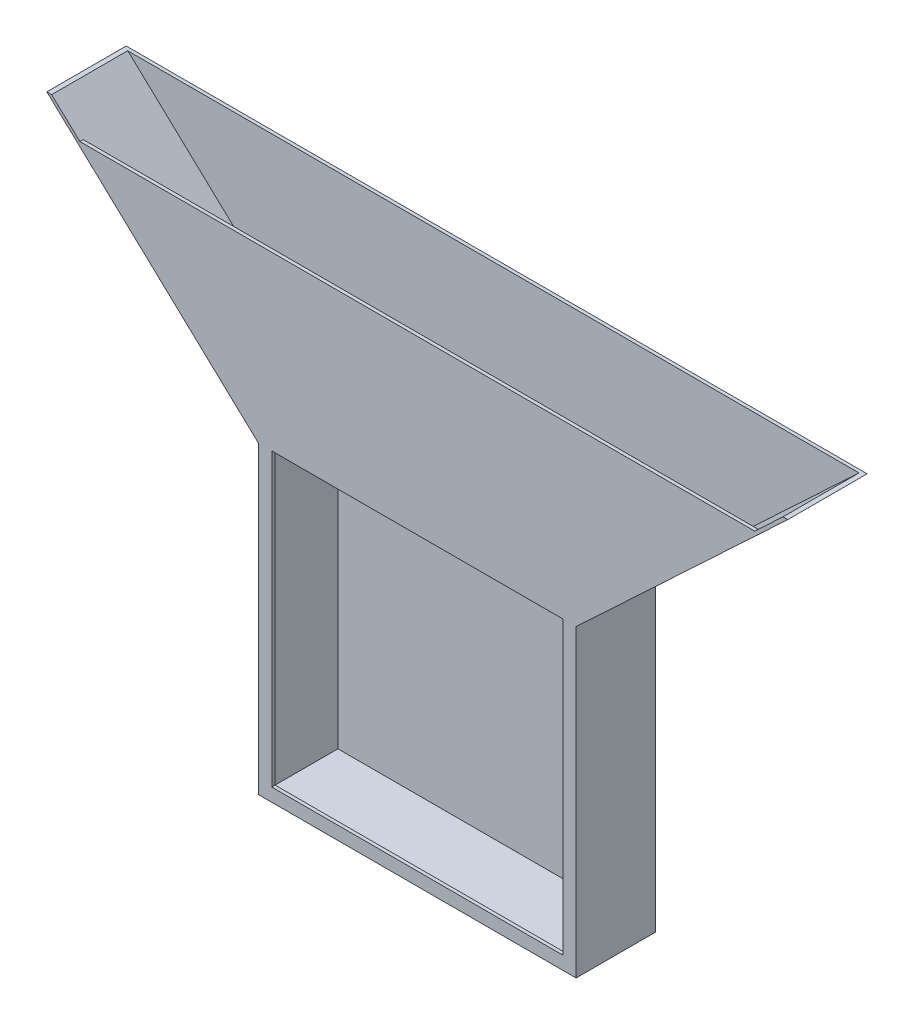
ISO-10303-21;
HEADER;
FILE_DESCRIPTION(('STEP AP214'),'2;1');
FILE_NAME('part.step','',(''),(''),'','','');
FILE_SCHEMA(('AUTOMOTIVE_DESIGN { 1 0 10303 214 1 1 1 1 }'));
ENDSEC;
DATA;
#1=APPLICATION_CONTEXT('core data for automotive mechanical design processes');
#2=APPLICATION_PROTOCOL_DEFINITION('international standard','automotive_design',2000,#1);
#3=PRODUCT_CONTEXT('',#1,'mechanical');
#4=PRODUCT('Part','Part','',(#3));
#5=PRODUCT_RELATED_PRODUCT_CATEGORY('part','',(#4));
#6=PRODUCT_DEFINITION_FORMATION('','',#4);
#7=PRODUCT_DEFINITION_CONTEXT('part definition',#1,'design');
#8=PRODUCT_DEFINITION('design','',#6,#7);
#9=PRODUCT_DEFINITION_SHAPE('','',#8);
#10=(LENGTH_UNIT() NAMED_UNIT(*) SI_UNIT(.MILLI.,.METRE.));
#11=(NAMED_UNIT(*) PLANE_ANGLE_UNIT() SI_UNIT($,.RADIAN.));
#12=(NAMED_UNIT(*) SI_UNIT($,.STERADIAN.) SOLID_ANGLE_UNIT());
#13=UNCERTAINTY_MEASURE_WITH_UNIT(LENGTH_MEASURE(1.E-05),#10,'distance_accuracy_value','');
#14=(GEOMETRIC_REPRESENTATION_CONTEXT(3) GLOBAL_UNCERTAINTY_ASSIGNED_CONTEXT((#13)) GLOBAL_UNIT_ASSIGNED_CONTEXT((#10,
#11,#12)) REPRESENTATION_CONTEXT('',''));
#15=CARTESIAN_POINT('',(0.,0.,0.));
#16=DIRECTION('',(0.,0.,1.));
#17=DIRECTION('',(1.,0.,0.));
#18=AXIS2_PLACEMENT_3D('',#15,#16,#17);
#19=CARTESIAN_POINT('',(-355.6,336.55,38.1));
#20=DIRECTION('',(0.,-1.,0.));
#21=DIRECTION('',(1.,0.,0.));
#22=AXIS2_PLACEMENT_3D('',#19,#20,#21);
#23=PLANE('',#22);
#24=DIRECTION('',(-1.,0.,0.));
#25=VECTOR('',#24,1.);
#26=CARTESIAN_POINT('',(-355.6,336.55,38.1));
#27=LINE('',#26,#25);
#28=CARTESIAN_POINT('',(-350.957787584447,336.55,38.1));
#29=VERTEX_POINT('',#28);
#30=CARTESIAN_POINT('',(-355.6,336.55,38.1));
#31=VERTEX_POINT('',#30);
#32=EDGE_CURVE('E271',#29,#31,#27,.T.);
#33=ORIENTED_EDGE('',*,*,#32,.F.);
#34=DIRECTION('',(0.,0.,-1.));
#35=VECTOR('',#34,1.);
#36=CARTESIAN_POINT('',(-350.957787584447,336.55,38.1));
#37=LINE('',#36,#35);
#38=CARTESIAN_POINT('',(-350.957787584447,336.55,-34.925));
#39=VERTEX_POINT('',#38);
#40=EDGE_CURVE('E254',#29,#39,#37,.T.);
#41=ORIENTED_EDGE('',*,*,#40,.T.);
#42=DIRECTION('',(-1.,0.,0.));
#43=VECTOR('',#42,1.);
#44=CARTESIAN_POINT('',(-355.6,336.55,-34.925));
#45=LINE('',#44,#43);
#46=CARTESIAN_POINT('',(350.957787584447,336.55,-34.925));
#47=VERTEX_POINT('',#46);
#48=EDGE_CURVE('E231',#47,#39,#45,.T.);
#49=ORIENTED_EDGE('',*,*,#48,.F.);
#50=DIRECTION('',(0.,0.,-1.));
#51=VECTOR('',#50,1.);
#52=CARTESIAN_POINT('',(350.957787584447,336.55,38.1));
#53=LINE('',#52,#51);
#54=CARTESIAN_POINT('',(350.957787584447,336.55,38.1));
#55=VERTEX_POINT('',#54);
#56=EDGE_CURVE('E250',#55,#47,#53,.T.);
#57=ORIENTED_EDGE('',*,*,#56,.F.);
#58=CARTESIAN_POINT('',(355.6,336.55,38.1));
#59=VERTEX_POINT('',#58);
#60=EDGE_CURVE('E187',#59,#55,#27,.T.);
#61=ORIENTED_EDGE('',*,*,#60,.F.);
#62=DIRECTION('',(0.,0.,-1.));
#63=VECTOR('',#62,1.);
#64=CARTESIAN_POINT('',(355.6,336.55,38.1));
#65=LINE('',#64,#63);
#66=CARTESIAN_POINT('',(355.6,336.55,-38.1));
#67=VERTEX_POINT('',#66);
#68=EDGE_CURVE('E287',#59,#67,#65,.T.);
#69=ORIENTED_EDGE('',*,*,#68,.T.);
#70=DIRECTION('',(-1.,0.,0.));
#71=VECTOR('',#70,1.);
#72=CARTESIAN_POINT('',(-355.6,336.55,-38.1));
#73=LINE('',#72,#71);
#74=CARTESIAN_POINT('',(-355.6,336.55,-38.1));
#75=VERTEX_POINT('',#74);
#76=EDGE_CURVE('E263',#67,#75,#73,.T.);
#77=ORIENTED_EDGE('',*,*,#76,.T.);
#78=DIRECTION('',(0.,0.,-1.));
#79=VECTOR('',#78,1.);
#80=CARTESIAN_POINT('',(-355.6,336.55,38.1));
#81=LINE('',#80,#79);
#82=EDGE_CURVE('E273',#31,#75,#81,.T.);
#83=ORIENTED_EDGE('',*,*,#82,.F.);
#84=EDGE_LOOP('',(#33,#41,#49,#57,#61,#69,#77,#83));
#85=FACE_BOUND('',#84,.T.);
#86=ADVANCED_FACE('F35',(#85),#23,.F.);
#87=CARTESIAN_POINT('',(-355.6,336.55,38.1));
#88=DIRECTION('',(0.68394112888133,0.729537204140085,0.));
#89=DIRECTION('',(-0.729537204140085,0.68394112888133,0.));
#90=AXIS2_PLACEMENT_3D('',#87,#88,#89);
#91=PLANE('',#90);
#92=DIRECTION('',(0.729537204140085,-0.68394112888133,0.));
#93=VECTOR('',#92,1.);
#94=CARTESIAN_POINT('',(-355.6,336.55,-38.1));
#95=LINE('',#94,#93);
#96=CARTESIAN_POINT('',(-152.4,146.05,-38.1));
#97=VERTEX_POINT('',#96);
#98=EDGE_CURVE('E226',#75,#97,#95,.T.);
#99=ORIENTED_EDGE('',*,*,#98,.T.);
#100=DIRECTION('',(0.,0.,-1.));
#101=VECTOR('',#100,1.);
#102=CARTESIAN_POINT('',(-152.4,146.05,38.1));
#103=LINE('',#102,#101);
#104=CARTESIAN_POINT('',(-152.4,146.05,38.1));
#105=VERTEX_POINT('',#104);
#106=EDGE_CURVE('E11',#105,#97,#103,.T.);
#107=ORIENTED_EDGE('',*,*,#106,.F.);
#108=DIRECTION('',(0.729537204140085,-0.68394112888133,0.));
#109=VECTOR('',#108,1.);
#110=CARTESIAN_POINT('',(-355.6,336.55,38.1));
#111=LINE('',#110,#109);
#112=EDGE_CURVE('E259',#31,#105,#111,.T.);
#113=ORIENTED_EDGE('',*,*,#112,.F.);
#114=ORIENTED_EDGE('',*,*,#82,.T.);
#115=EDGE_LOOP('',(#99,#107,#113,#114));
#116=FACE_BOUND('',#115,.T.);
#117=ADVANCED_FACE('F37',(#116),#91,.F.);
#118=CARTESIAN_POINT('',(-152.4,146.05,38.1));
#119=DIRECTION('',(1.,0.,0.));
#120=DIRECTION('',(0.,1.,0.));
#121=AXIS2_PLACEMENT_3D('',#118,#119,#120);
#122=PLANE('',#121);
#123=DIRECTION('',(0.,-1.,0.));
#124=VECTOR('',#123,1.);
#125=CARTESIAN_POINT('',(-152.4,146.05,-38.1));
#126=LINE('',#125,#124);
#127=CARTESIAN_POINT('',(-152.4,-146.05,-38.1));
#128=VERTEX_POINT('',#127);
#129=EDGE_CURVE('E276',#97,#128,#126,.T.);
#130=ORIENTED_EDGE('',*,*,#129,.T.);
#131=DIRECTION('',(0.,0.,-1.));
#132=VECTOR('',#131,1.);
#133=CARTESIAN_POINT('',(-152.4,-146.05,38.1));
#134=LINE('',#133,#132);
#135=CARTESIAN_POINT('',(-152.4,-146.05,38.1));
#136=VERTEX_POINT('',#135);
#137=EDGE_CURVE('E43',#136,#128,#134,.T.);
#138=ORIENTED_EDGE('',*,*,#137,.F.);
#139=DIRECTION('',(0.,-1.,0.));
#140=VECTOR('',#139,1.);
#141=CARTESIAN_POINT('',(-152.4,146.05,38.1));
#142=LINE('',#141,#140);
#143=EDGE_CURVE('E262',#105,#136,#142,.T.);
#144=ORIENTED_EDGE('',*,*,#143,.F.);
#145=ORIENTED_EDGE('',*,*,#106,.T.);
#146=EDGE_LOOP('',(#130,#138,#144,#145));
#147=FACE_BOUND('',#146,.T.);
#148=ADVANCED_FACE('F319',(#147),#122,.F.);
#149=CARTESIAN_POINT('',(-152.4,-146.05,38.1));
#150=DIRECTION('',(0.,1.,0.));
#151=DIRECTION('',(0.,0.,1.));
#152=AXIS2_PLACEMENT_3D('',#149,#150,#151);
#153=PLANE('',#152);
#154=DIRECTION('',(1.,0.,0.));
#155=VECTOR('',#154,1.);
#156=CARTESIAN_POINT('',(-152.4,-146.05,-38.1));
#157=LINE('',#156,#155);
#158=CARTESIAN_POINT('',(152.4,-146.05,-38.1));
#159=VERTEX_POINT('',#158);
#160=EDGE_CURVE('E278',#128,#159,#157,.T.);
#161=ORIENTED_EDGE('',*,*,#160,.T.);
#162=DIRECTION('',(0.,0.,-1.));
#163=VECTOR('',#162,1.);
#164=CARTESIAN_POINT('',(152.4,-146.05,38.1));
#165=LINE('',#164,#163);
#166=CARTESIAN_POINT('',(152.4,-146.05,38.1));
#167=VERTEX_POINT('',#166);
#168=EDGE_CURVE('E293',#167,#159,#165,.T.);
#169=ORIENTED_EDGE('',*,*,#168,.F.);
#170=DIRECTION('',(1.,0.,0.));
#171=VECTOR('',#170,1.);
#172=CARTESIAN_POINT('',(-152.4,-146.05,38.1));
#173=LINE('',#172,#171);
#174=EDGE_CURVE('E265',#136,#167,#173,.T.);
#175=ORIENTED_EDGE('',*,*,#174,.F.);
#176=ORIENTED_EDGE('',*,*,#137,.T.);
#177=EDGE_LOOP('',(#161,#169,#175,#176));
#178=FACE_BOUND('',#177,.T.);
#179=ADVANCED_FACE('F300',(#178),#153,.F.);
#180=CARTESIAN_POINT('',(152.4,146.05,38.1));
#181=DIRECTION('',(-1.,0.,0.));
#182=DIRECTION('',(0.,-1.,0.));
#183=AXIS2_PLACEMENT_3D('',#180,#181,#182);
#184=PLANE('',#183);
#185=DIRECTION('',(0.,1.,0.));
#186=VECTOR('',#185,1.);
#187=CARTESIAN_POINT('',(152.4,146.05,-38.1));
#188=LINE('',#187,#186);
#189=CARTESIAN_POINT('',(152.4,146.05,-38.1));
#190=VERTEX_POINT('',#189);
#191=EDGE_CURVE('E280',#159,#190,#188,.T.);
#192=ORIENTED_EDGE('',*,*,#191,.T.);
#193=DIRECTION('',(0.,0.,-1.));
#194=VECTOR('',#193,1.);
#195=CARTESIAN_POINT('',(152.4,146.05,38.1));
#196=LINE('',#195,#194);
#197=CARTESIAN_POINT('',(152.4,146.05,38.1));
#198=VERTEX_POINT('',#197);
#199=EDGE_CURVE('E290',#198,#190,#196,.T.);
#200=ORIENTED_EDGE('',*,*,#199,.F.);
#201=DIRECTION('',(0.,1.,0.));
#202=VECTOR('',#201,1.);
#203=CARTESIAN_POINT('',(152.4,146.05,38.1));
#204=LINE('',#203,#202);
#205=EDGE_CURVE('E267',#167,#198,#204,.T.);
#206=ORIENTED_EDGE('',*,*,#205,.F.);
#207=ORIENTED_EDGE('',*,*,#168,.T.);
#208=EDGE_LOOP('',(#192,#200,#206,#207));
#209=FACE_BOUND('',#208,.T.);
#210=ADVANCED_FACE('F311',(#209),#184,.F.);
#211=CARTESIAN_POINT('',(152.4,146.05,38.1));
#212=DIRECTION('',(-0.68394112888133,0.729537204140085,0.));
#213=DIRECTION('',(-0.729537204140085,-0.68394112888133,0.));
#214=AXIS2_PLACEMENT_3D('',#211,#212,#213);
#215=PLANE('',#214);
#216=DIRECTION('',(0.729537204140085,0.68394112888133,0.));
#217=VECTOR('',#216,1.);
#218=CARTESIAN_POINT('',(152.4,146.05,-38.1));
#219=LINE('',#218,#217);
#220=EDGE_CURVE('E282',#190,#67,#219,.T.);
#221=ORIENTED_EDGE('',*,*,#220,.T.);
#222=ORIENTED_EDGE('',*,*,#68,.F.);
#223=DIRECTION('',(0.729537204140085,0.68394112888133,0.));
#224=VECTOR('',#223,1.);
#225=CARTESIAN_POINT('',(152.4,146.05,38.1));
#226=LINE('',#225,#224);
#227=EDGE_CURVE('E269',#198,#59,#226,.T.);
#228=ORIENTED_EDGE('',*,*,#227,.F.);
#229=ORIENTED_EDGE('',*,*,#199,.T.);
#230=EDGE_LOOP('',(#221,#222,#228,#229));
#231=FACE_BOUND('',#230,.T.);
#232=ADVANCED_FACE('F315',(#231),#215,.F.);
#233=CARTESIAN_POINT('',(0.,0.,38.1));
#234=DIRECTION('',(0.,0.,1.));
#235=DIRECTION('',(1.,0.,0.));
#236=AXIS2_PLACEMENT_3D('',#233,#234,#235);
#237=PLANE('',#236);
#238=DIRECTION('',(0.729537204140085,-0.68394112888133,0.));
#239=VECTOR('',#238,1.);
#240=CARTESIAN_POINT('',(3.75571266839779,4.00609351295764,38.1));
#241=LINE('',#240,#239);
#242=CARTESIAN_POINT('',(-323.864454251114,311.15,38.1));
#243=VERTEX_POINT('',#242);
#244=EDGE_CURVE('E174',#29,#243,#241,.T.);
#245=ORIENTED_EDGE('',*,*,#244,.F.);
#246=ORIENTED_EDGE('',*,*,#32,.T.);
#247=ORIENTED_EDGE('',*,*,#112,.T.);
#248=ORIENTED_EDGE('',*,*,#143,.T.);
#249=ORIENTED_EDGE('',*,*,#174,.T.);
#250=ORIENTED_EDGE('',*,*,#205,.T.);
#251=ORIENTED_EDGE('',*,*,#227,.T.);
#252=ORIENTED_EDGE('',*,*,#60,.T.);
#253=DIRECTION('',(0.729537204140084,0.683941128881331,0.));
#254=VECTOR('',#253,1.);
#255=CARTESIAN_POINT('',(-3.7557126683976,4.00609351295744,38.1));
#256=LINE('',#255,#254);
#257=CARTESIAN_POINT('',(323.864454251114,311.15,38.1));
#258=VERTEX_POINT('',#257);
#259=EDGE_CURVE('E166',#258,#55,#256,.T.);
#260=ORIENTED_EDGE('',*,*,#259,.F.);
#261=DIRECTION('',(1.,0.,0.));
#262=VECTOR('',#261,1.);
#263=CARTESIAN_POINT('',(0.,311.15,38.1));
#264=LINE('',#263,#262);
#265=EDGE_CURVE('E177',#243,#258,#264,.T.);
#266=ORIENTED_EDGE('',*,*,#265,.F.);
#267=EDGE_LOOP('',(#245,#246,#247,#248,#249,#250,#251,#252,#260,#266));
#268=FACE_BOUND('',#267,.T.);
#269=DIRECTION('',(1.,0.,0.));
#270=VECTOR('',#269,1.);
#271=CARTESIAN_POINT('',(0.,-133.35,38.1));
#272=LINE('',#271,#270);
#273=CARTESIAN_POINT('',(-139.7,-133.35,38.1));
#274=VERTEX_POINT('',#273);
#275=CARTESIAN_POINT('',(139.7,-133.35,38.1));
#276=VERTEX_POINT('',#275);
#277=EDGE_CURVE('E50',#274,#276,#272,.T.);
#278=ORIENTED_EDGE('',*,*,#277,.F.);
#279=DIRECTION('',(0.,1.,0.));
#280=VECTOR('',#279,1.);
#281=CARTESIAN_POINT('',(-139.7,0.,38.1));
#282=LINE('',#281,#280);
#283=CARTESIAN_POINT('',(-139.7,146.05,38.1));
#284=VERTEX_POINT('',#283);
#285=EDGE_CURVE('E200',#274,#284,#282,.T.);
#286=ORIENTED_EDGE('',*,*,#285,.T.);
#287=DIRECTION('',(1.,0.,0.));
#288=VECTOR('',#287,1.);
#289=CARTESIAN_POINT('',(0.,146.05,38.1));
#290=LINE('',#289,#288);
#291=CARTESIAN_POINT('',(139.7,146.05,38.1));
#292=VERTEX_POINT('',#291);
#293=EDGE_CURVE('E197',#284,#292,#290,.T.);
#294=ORIENTED_EDGE('',*,*,#293,.T.);
#295=DIRECTION('',(0.,1.,0.));
#296=VECTOR('',#295,1.);
#297=CARTESIAN_POINT('',(139.7,0.,38.1));
#298=LINE('',#297,#296);
#299=EDGE_CURVE('E195',#276,#292,#298,.T.);
#300=ORIENTED_EDGE('',*,*,#299,.F.);
#301=EDGE_LOOP('',(#278,#286,#294,#300));
#302=FACE_BOUND('',#301,.T.);
#303=ADVANCED_FACE('F184',(#268,#302),#237,.T.);
#304=CARTESIAN_POINT('',(0.,0.,-38.1));
#305=DIRECTION('',(0.,0.,1.));
#306=DIRECTION('',(1.,0.,0.));
#307=AXIS2_PLACEMENT_3D('',#304,#305,#306);
#308=PLANE('',#307);
#309=ORIENTED_EDGE('',*,*,#98,.F.);
#310=ORIENTED_EDGE('',*,*,#76,.F.);
#311=ORIENTED_EDGE('',*,*,#220,.F.);
#312=ORIENTED_EDGE('',*,*,#191,.F.);
#313=ORIENTED_EDGE('',*,*,#160,.F.);
#314=ORIENTED_EDGE('',*,*,#129,.F.);
#315=EDGE_LOOP('',(#309,#310,#311,#312,#313,#314));
#316=FACE_BOUND('',#315,.T.);
#317=ADVANCED_FACE('F306',(#316),#308,.F.);
#318=CARTESIAN_POINT('',(-353.428486915802,338.866280623145,38.1));
#319=DIRECTION('',(0.68394112888133,0.729537204140085,0.));
#320=DIRECTION('',(-0.729537204140085,0.68394112888133,0.));
#321=AXIS2_PLACEMENT_3D('',#318,#319,#320);
#322=PLANE('',#321);
#323=DIRECTION('',(0.,0.,-1.));
#324=VECTOR('',#323,1.);
#325=CARTESIAN_POINT('',(-149.225,147.425511639581,38.1));
#326=LINE('',#325,#324);
#327=CARTESIAN_POINT('',(-149.225,147.425511639581,34.925));
#328=VERTEX_POINT('',#327);
#329=CARTESIAN_POINT('',(-149.225,147.425511639581,-34.925));
#330=VERTEX_POINT('',#329);
#331=EDGE_CURVE('E223',#328,#330,#326,.T.);
#332=ORIENTED_EDGE('',*,*,#331,.T.);
#333=DIRECTION('',(0.729537204140085,-0.68394112888133,0.));
#334=VECTOR('',#333,1.);
#335=CARTESIAN_POINT('',(-353.428486915802,338.866280623145,-34.925));
#336=LINE('',#335,#334);
#337=EDGE_CURVE('E220',#39,#330,#336,.T.);
#338=ORIENTED_EDGE('',*,*,#337,.F.);
#339=ORIENTED_EDGE('',*,*,#40,.F.);
#340=ORIENTED_EDGE('',*,*,#244,.T.);
#341=DIRECTION('',(0.,0.,1.));
#342=VECTOR('',#341,1.);
#343=CARTESIAN_POINT('',(-323.864454251114,311.15,-34.925));
#344=LINE('',#343,#342);
#345=CARTESIAN_POINT('',(-323.864454251114,311.15,34.925));
#346=VERTEX_POINT('',#345);
#347=EDGE_CURVE('E173',#346,#243,#344,.T.);
#348=ORIENTED_EDGE('',*,*,#347,.F.);
#349=DIRECTION('',(0.729537204140085,-0.68394112888133,0.));
#350=VECTOR('',#349,1.);
#351=CARTESIAN_POINT('',(-353.428486915802,338.866280623145,34.925));
#352=LINE('',#351,#350);
#353=EDGE_CURVE('E228',#346,#328,#352,.T.);
#354=ORIENTED_EDGE('',*,*,#353,.T.);
#355=EDGE_LOOP('',(#332,#338,#339,#340,#348,#354));
#356=FACE_BOUND('',#355,.T.);
#357=ADVANCED_FACE('F341',(#356),#322,.T.);
#358=CARTESIAN_POINT('',(-149.225,146.05,38.1));
#359=DIRECTION('',(1.,0.,0.));
#360=DIRECTION('',(0.,1.,0.));
#361=AXIS2_PLACEMENT_3D('',#358,#359,#360);
#362=PLANE('',#361);
#363=DIRECTION('',(0.,-1.,0.));
#364=VECTOR('',#363,1.);
#365=CARTESIAN_POINT('',(-149.225,146.05,-34.925));
#366=LINE('',#365,#364);
#367=CARTESIAN_POINT('',(-149.225,-142.875,-34.925));
#368=VERTEX_POINT('',#367);
#369=EDGE_CURVE('E222',#330,#368,#366,.T.);
#370=ORIENTED_EDGE('',*,*,#369,.F.);
#371=ORIENTED_EDGE('',*,*,#331,.F.);
#372=DIRECTION('',(0.,-1.,0.));
#373=VECTOR('',#372,1.);
#374=CARTESIAN_POINT('',(-149.225,146.05,34.925));
#375=LINE('',#374,#373);
#376=CARTESIAN_POINT('',(-149.225,-142.875,34.925));
#377=VERTEX_POINT('',#376);
#378=EDGE_CURVE('E230',#328,#377,#375,.T.);
#379=ORIENTED_EDGE('',*,*,#378,.T.);
#380=DIRECTION('',(0.,0.,-1.));
#381=VECTOR('',#380,1.);
#382=CARTESIAN_POINT('',(-149.225,-142.875,38.1));
#383=LINE('',#382,#381);
#384=EDGE_CURVE('E227',#377,#368,#383,.T.);
#385=ORIENTED_EDGE('',*,*,#384,.T.);
#386=EDGE_LOOP('',(#370,#371,#379,#385));
#387=FACE_BOUND('',#386,.T.);
#388=ADVANCED_FACE('F345',(#387),#362,.T.);
#389=CARTESIAN_POINT('',(-152.4,-142.875,38.1));
#390=DIRECTION('',(0.,1.,0.));
#391=DIRECTION('',(0.,0.,1.));
#392=AXIS2_PLACEMENT_3D('',#389,#390,#391);
#393=PLANE('',#392);
#394=DIRECTION('',(1.,0.,0.));
#395=VECTOR('',#394,1.);
#396=CARTESIAN_POINT('',(-152.4,-142.875,-34.925));
#397=LINE('',#396,#395);
#398=CARTESIAN_POINT('',(149.225,-142.875,-34.925));
#399=VERTEX_POINT('',#398);
#400=EDGE_CURVE('E233',#368,#399,#397,.T.);
#401=ORIENTED_EDGE('',*,*,#400,.F.);
#402=ORIENTED_EDGE('',*,*,#384,.F.);
#403=DIRECTION('',(1.,0.,0.));
#404=VECTOR('',#403,1.);
#405=CARTESIAN_POINT('',(-152.4,-142.875,34.925));
#406=LINE('',#405,#404);
#407=CARTESIAN_POINT('',(149.225,-142.875,34.925));
#408=VERTEX_POINT('',#407);
#409=EDGE_CURVE('E238',#377,#408,#406,.T.);
#410=ORIENTED_EDGE('',*,*,#409,.T.);
#411=DIRECTION('',(0.,0.,-1.));
#412=VECTOR('',#411,1.);
#413=CARTESIAN_POINT('',(149.225,-142.875,38.1));
#414=LINE('',#413,#412);
#415=EDGE_CURVE('E236',#408,#399,#414,.T.);
#416=ORIENTED_EDGE('',*,*,#415,.T.);
#417=EDGE_LOOP('',(#401,#402,#410,#416));
#418=FACE_BOUND('',#417,.T.);
#419=ADVANCED_FACE('F348',(#418),#393,.T.);
#420=CARTESIAN_POINT('',(149.225,146.05,38.1));
#421=DIRECTION('',(-1.,0.,0.));
#422=DIRECTION('',(0.,-1.,0.));
#423=AXIS2_PLACEMENT_3D('',#420,#421,#422);
#424=PLANE('',#423);
#425=DIRECTION('',(0.,1.,0.));
#426=VECTOR('',#425,1.);
#427=CARTESIAN_POINT('',(149.225,146.05,-34.925));
#428=LINE('',#427,#426);
#429=CARTESIAN_POINT('',(149.225,147.425511639581,-34.925));
#430=VERTEX_POINT('',#429);
#431=EDGE_CURVE('E240',#399,#430,#428,.T.);
#432=ORIENTED_EDGE('',*,*,#431,.F.);
#433=ORIENTED_EDGE('',*,*,#415,.F.);
#434=DIRECTION('',(0.,1.,0.));
#435=VECTOR('',#434,1.);
#436=CARTESIAN_POINT('',(149.225,146.05,34.925));
#437=LINE('',#436,#435);
#438=CARTESIAN_POINT('',(149.225,147.425511639581,34.925));
#439=VERTEX_POINT('',#438);
#440=EDGE_CURVE('E245',#408,#439,#437,.T.);
#441=ORIENTED_EDGE('',*,*,#440,.T.);
#442=DIRECTION('',(0.,0.,-1.));
#443=VECTOR('',#442,1.);
#444=CARTESIAN_POINT('',(149.225,147.425511639581,38.1));
#445=LINE('',#444,#443);
#446=EDGE_CURVE('E243',#439,#430,#445,.T.);
#447=ORIENTED_EDGE('',*,*,#446,.T.);
#448=EDGE_LOOP('',(#432,#433,#441,#447));
#449=FACE_BOUND('',#448,.T.);
#450=ADVANCED_FACE('F333',(#449),#424,.T.);
#451=CARTESIAN_POINT('',(150.228486915802,148.366280623145,38.1));
#452=DIRECTION('',(-0.68394112888133,0.729537204140085,0.));
#453=DIRECTION('',(-0.729537204140085,-0.68394112888133,0.));
#454=AXIS2_PLACEMENT_3D('',#451,#452,#453);
#455=PLANE('',#454);
#456=DIRECTION('',(0.729537204140085,0.68394112888133,0.));
#457=VECTOR('',#456,1.);
#458=CARTESIAN_POINT('',(150.228486915802,148.366280623145,34.925));
#459=LINE('',#458,#457);
#460=CARTESIAN_POINT('',(323.864454251114,311.15,34.925));
#461=VERTEX_POINT('',#460);
#462=EDGE_CURVE('E170',#439,#461,#459,.T.);
#463=ORIENTED_EDGE('',*,*,#462,.T.);
#464=DIRECTION('',(0.,0.,1.));
#465=VECTOR('',#464,1.);
#466=CARTESIAN_POINT('',(323.864454251114,311.15,-34.925));
#467=LINE('',#466,#465);
#468=EDGE_CURVE('E161',#461,#258,#467,.T.);
#469=ORIENTED_EDGE('',*,*,#468,.T.);
#470=ORIENTED_EDGE('',*,*,#259,.T.);
#471=ORIENTED_EDGE('',*,*,#56,.T.);
#472=DIRECTION('',(0.729537204140085,0.68394112888133,0.));
#473=VECTOR('',#472,1.);
#474=CARTESIAN_POINT('',(150.228486915802,148.366280623145,-34.925));
#475=LINE('',#474,#473);
#476=EDGE_CURVE('E247',#430,#47,#475,.T.);
#477=ORIENTED_EDGE('',*,*,#476,.F.);
#478=ORIENTED_EDGE('',*,*,#446,.F.);
#479=EDGE_LOOP('',(#463,#469,#470,#471,#477,#478));
#480=FACE_BOUND('',#479,.T.);
#481=ADVANCED_FACE('F163',(#480),#455,.T.);
#482=CARTESIAN_POINT('',(0.,0.,34.925));
#483=DIRECTION('',(0.,0.,1.));
#484=DIRECTION('',(1.,0.,0.));
#485=AXIS2_PLACEMENT_3D('',#482,#483,#484);
#486=PLANE('',#485);
#487=DIRECTION('',(0.,1.,0.));
#488=VECTOR('',#487,1.);
#489=CARTESIAN_POINT('',(-139.7,0.,34.925));
#490=LINE('',#489,#488);
#491=CARTESIAN_POINT('',(-139.7,-133.35,34.925));
#492=VERTEX_POINT('',#491);
#493=CARTESIAN_POINT('',(-139.7,146.05,34.925));
#494=VERTEX_POINT('',#493);
#495=EDGE_CURVE('E215',#492,#494,#490,.T.);
#496=ORIENTED_EDGE('',*,*,#495,.F.);
#497=DIRECTION('',(1.,0.,0.));
#498=VECTOR('',#497,1.);
#499=CARTESIAN_POINT('',(0.,-133.35,34.925));
#500=LINE('',#499,#498);
#501=CARTESIAN_POINT('',(139.7,-133.35,34.925));
#502=VERTEX_POINT('',#501);
#503=EDGE_CURVE('E217',#492,#502,#500,.T.);
#504=ORIENTED_EDGE('',*,*,#503,.T.);
#505=DIRECTION('',(0.,1.,0.));
#506=VECTOR('',#505,1.);
#507=CARTESIAN_POINT('',(139.7,0.,34.925));
#508=LINE('',#507,#506);
#509=CARTESIAN_POINT('',(139.7,146.05,34.925));
#510=VERTEX_POINT('',#509);
#511=EDGE_CURVE('E206',#502,#510,#508,.T.);
#512=ORIENTED_EDGE('',*,*,#511,.T.);
#513=DIRECTION('',(1.,0.,0.));
#514=VECTOR('',#513,1.);
#515=CARTESIAN_POINT('',(0.,146.05,34.925));
#516=LINE('',#515,#514);
#517=EDGE_CURVE('E213',#494,#510,#516,.T.);
#518=ORIENTED_EDGE('',*,*,#517,.F.);
#519=EDGE_LOOP('',(#496,#504,#512,#518));
#520=FACE_BOUND('',#519,.T.);
#521=ORIENTED_EDGE('',*,*,#353,.F.);
#522=DIRECTION('',(1.,0.,0.));
#523=VECTOR('',#522,1.);
#524=CARTESIAN_POINT('',(0.,311.15,34.925));
#525=LINE('',#524,#523);
#526=EDGE_CURVE('E191',#346,#461,#525,.T.);
#527=ORIENTED_EDGE('',*,*,#526,.T.);
#528=ORIENTED_EDGE('',*,*,#462,.F.);
#529=ORIENTED_EDGE('',*,*,#440,.F.);
#530=ORIENTED_EDGE('',*,*,#409,.F.);
#531=ORIENTED_EDGE('',*,*,#378,.F.);
#532=EDGE_LOOP('',(#521,#527,#528,#529,#530,#531));
#533=FACE_BOUND('',#532,.T.);
#534=ADVANCED_FACE('F338',(#520,#533),#486,.F.);
#535=CARTESIAN_POINT('',(0.,0.,-34.925));
#536=DIRECTION('',(0.,0.,1.));
#537=DIRECTION('',(1.,0.,0.));
#538=AXIS2_PLACEMENT_3D('',#535,#536,#537);
#539=PLANE('',#538);
#540=ORIENTED_EDGE('',*,*,#476,.T.);
#541=ORIENTED_EDGE('',*,*,#48,.T.);
#542=ORIENTED_EDGE('',*,*,#337,.T.);
#543=ORIENTED_EDGE('',*,*,#369,.T.);
#544=ORIENTED_EDGE('',*,*,#400,.T.);
#545=ORIENTED_EDGE('',*,*,#431,.T.);
#546=EDGE_LOOP('',(#540,#541,#542,#543,#544,#545));
#547=FACE_BOUND('',#546,.T.);
#548=ADVANCED_FACE('F327',(#547),#539,.T.);
#549=CARTESIAN_POINT('',(0.,-133.35,-34.925));
#550=DIRECTION('',(0.,-1.,0.));
#551=DIRECTION('',(0.,0.,-1.));
#552=AXIS2_PLACEMENT_3D('',#549,#550,#551);
#553=PLANE('',#552);
#554=DIRECTION('',(0.,0.,1.));
#555=VECTOR('',#554,1.);
#556=CARTESIAN_POINT('',(-139.7,-133.35,-34.925));
#557=LINE('',#556,#555);
#558=EDGE_CURVE('E204',#492,#274,#557,.T.);
#559=ORIENTED_EDGE('',*,*,#558,.T.);
#560=ORIENTED_EDGE('',*,*,#277,.T.);
#561=DIRECTION('',(0.,0.,1.));
#562=VECTOR('',#561,1.);
#563=CARTESIAN_POINT('',(139.7,-133.35,-34.925));
#564=LINE('',#563,#562);
#565=EDGE_CURVE('E203',#502,#276,#564,.T.);
#566=ORIENTED_EDGE('',*,*,#565,.F.);
#567=ORIENTED_EDGE('',*,*,#503,.F.);
#568=EDGE_LOOP('',(#559,#560,#566,#567));
#569=FACE_BOUND('',#568,.T.);
#570=ADVANCED_FACE('F449',(#569),#553,.F.);
#571=CARTESIAN_POINT('',(-139.7,0.,-34.925));
#572=DIRECTION('',(1.,0.,0.));
#573=DIRECTION('',(0.,0.,-1.));
#574=AXIS2_PLACEMENT_3D('',#571,#572,#573);
#575=PLANE('',#574);
#576=ORIENTED_EDGE('',*,*,#495,.T.);
#577=DIRECTION('',(0.,0.,1.));
#578=VECTOR('',#577,1.);
#579=CARTESIAN_POINT('',(-139.7,146.05,-34.925));
#580=LINE('',#579,#578);
#581=EDGE_CURVE('E207',#494,#284,#580,.T.);
#582=ORIENTED_EDGE('',*,*,#581,.T.);
#583=ORIENTED_EDGE('',*,*,#285,.F.);
#584=ORIENTED_EDGE('',*,*,#558,.F.);
#585=EDGE_LOOP('',(#576,#582,#583,#584));
#586=FACE_BOUND('',#585,.T.);
#587=ADVANCED_FACE('F455',(#586),#575,.T.);
#588=CARTESIAN_POINT('',(0.,146.05,-34.925));
#589=DIRECTION('',(0.,-1.,0.));
#590=DIRECTION('',(0.,0.,-1.));
#591=AXIS2_PLACEMENT_3D('',#588,#589,#590);
#592=PLANE('',#591);
#593=ORIENTED_EDGE('',*,*,#517,.T.);
#594=DIRECTION('',(0.,0.,1.));
#595=VECTOR('',#594,1.);
#596=CARTESIAN_POINT('',(139.7,146.05,-34.925));
#597=LINE('',#596,#595);
#598=EDGE_CURVE('E58',#510,#292,#597,.T.);
#599=ORIENTED_EDGE('',*,*,#598,.T.);
#600=ORIENTED_EDGE('',*,*,#293,.F.);
#601=ORIENTED_EDGE('',*,*,#581,.F.);
#602=EDGE_LOOP('',(#593,#599,#600,#601));
#603=FACE_BOUND('',#602,.T.);
#604=ADVANCED_FACE('F463',(#603),#592,.T.);
#605=CARTESIAN_POINT('',(139.7,0.,-34.925));
#606=DIRECTION('',(1.,0.,0.));
#607=DIRECTION('',(0.,0.,-1.));
#608=AXIS2_PLACEMENT_3D('',#605,#606,#607);
#609=PLANE('',#608);
#610=ORIENTED_EDGE('',*,*,#565,.T.);
#611=ORIENTED_EDGE('',*,*,#299,.T.);
#612=ORIENTED_EDGE('',*,*,#598,.F.);
#613=ORIENTED_EDGE('',*,*,#511,.F.);
#614=EDGE_LOOP('',(#610,#611,#612,#613));
#615=FACE_BOUND('',#614,.T.);
#616=ADVANCED_FACE('F472',(#615),#609,.F.);
#617=CARTESIAN_POINT('',(0.,311.15,-34.925));
#618=DIRECTION('',(0.,-1.,0.));
#619=DIRECTION('',(0.,0.,-1.));
#620=AXIS2_PLACEMENT_3D('',#617,#618,#619);
#621=PLANE('',#620);
#622=ORIENTED_EDGE('',*,*,#347,.T.);
#623=ORIENTED_EDGE('',*,*,#265,.T.);
#624=ORIENTED_EDGE('',*,*,#468,.F.);
#625=ORIENTED_EDGE('',*,*,#526,.F.);
#626=EDGE_LOOP('',(#622,#623,#624,#625));
#627=FACE_BOUND('',#626,.T.);
#628=ADVANCED_FACE('F178',(#627),#621,.F.);
#629=CLOSED_SHELL('',(#86,#117,#148,#179,#210,#232,#303,#317,#357,#388,#419,#450,#481,#534,#548,
#570,#587,#604,#616,#628));
#630=MANIFOLD_SOLID_BREP('B2',#629);
#631=ADVANCED_BREP_SHAPE_REPRESENTATION('',(#18,#630),#14);
#632=SHAPE_DEFINITION_REPRESENTATION(#9,#631);
ENDSEC;
END-ISO-10303-21;
